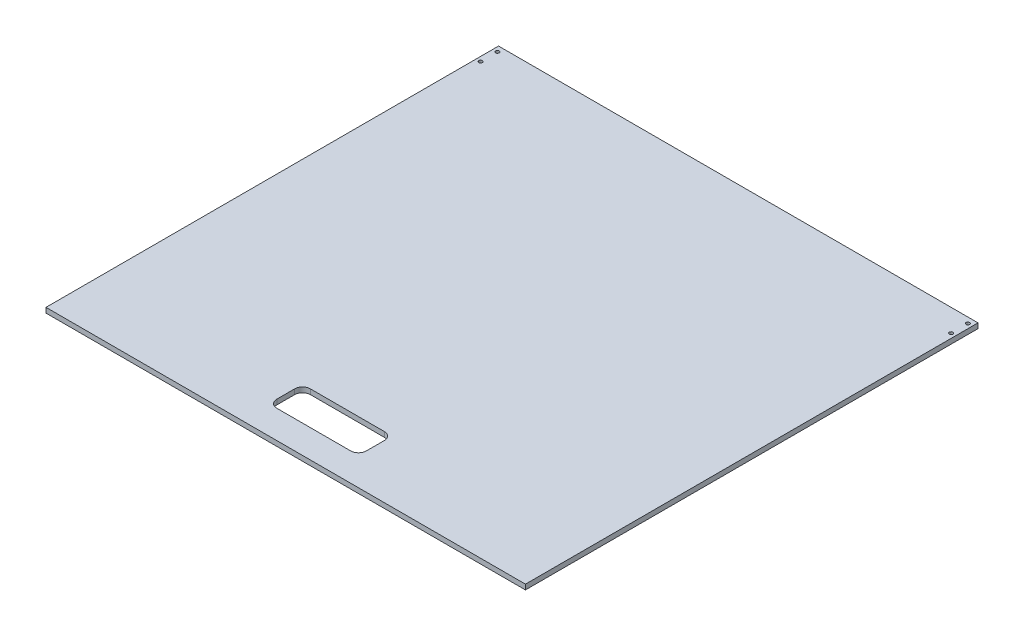
ISO-10303-21;
HEADER;
FILE_DESCRIPTION(('STEP AP214'),'2;1');
FILE_NAME('part.step','',(''),(''),'','','');
FILE_SCHEMA(('AUTOMOTIVE_DESIGN { 1 0 10303 214 1 1 1 1 }'));
ENDSEC;
DATA;
#1=APPLICATION_CONTEXT('core data for automotive mechanical design processes');
#2=APPLICATION_PROTOCOL_DEFINITION('international standard','automotive_design',2000,#1);
#3=PRODUCT_CONTEXT('',#1,'mechanical');
#4=PRODUCT('Part','Part','',(#3));
#5=PRODUCT_RELATED_PRODUCT_CATEGORY('part','',(#4));
#6=PRODUCT_DEFINITION_FORMATION('','',#4);
#7=PRODUCT_DEFINITION_CONTEXT('part definition',#1,'design');
#8=PRODUCT_DEFINITION('design','',#6,#7);
#9=PRODUCT_DEFINITION_SHAPE('','',#8);
#10=(LENGTH_UNIT() NAMED_UNIT(*) SI_UNIT(.MILLI.,.METRE.));
#11=(NAMED_UNIT(*) PLANE_ANGLE_UNIT() SI_UNIT($,.RADIAN.));
#12=(NAMED_UNIT(*) SI_UNIT($,.STERADIAN.) SOLID_ANGLE_UNIT());
#13=UNCERTAINTY_MEASURE_WITH_UNIT(LENGTH_MEASURE(1.E-05),#10,'distance_accuracy_value','');
#14=(GEOMETRIC_REPRESENTATION_CONTEXT(3) GLOBAL_UNCERTAINTY_ASSIGNED_CONTEXT((#13)) GLOBAL_UNIT_ASSIGNED_CONTEXT((#10,
#11,#12)) REPRESENTATION_CONTEXT('',''));
#15=CARTESIAN_POINT('',(0.,0.,0.));
#16=DIRECTION('',(0.,0.,1.));
#17=DIRECTION('',(1.,0.,0.));
#18=AXIS2_PLACEMENT_3D('',#15,#16,#17);
#19=CARTESIAN_POINT('',(214.,4.5,202.));
#20=DIRECTION('',(-1.,0.,0.));
#21=DIRECTION('',(0.,0.,1.));
#22=AXIS2_PLACEMENT_3D('',#19,#20,#21);
#23=PLANE('',#22);
#24=DIRECTION('',(0.,0.,-1.));
#25=VECTOR('',#24,1.);
#26=CARTESIAN_POINT('',(214.,0.,202.));
#27=LINE('',#26,#25);
#28=CARTESIAN_POINT('',(214.,0.,202.));
#29=VERTEX_POINT('',#28);
#30=CARTESIAN_POINT('',(214.,0.,-202.));
#31=VERTEX_POINT('',#30);
#32=EDGE_CURVE('E205',#29,#31,#27,.T.);
#33=ORIENTED_EDGE('',*,*,#32,.T.);
#34=DIRECTION('',(0.,-1.,0.));
#35=VECTOR('',#34,1.);
#36=CARTESIAN_POINT('',(214.,4.5,-202.));
#37=LINE('',#36,#35);
#38=CARTESIAN_POINT('',(214.,4.5,-202.));
#39=VERTEX_POINT('',#38);
#40=EDGE_CURVE('E11',#39,#31,#37,.T.);
#41=ORIENTED_EDGE('',*,*,#40,.F.);
#42=DIRECTION('',(0.,0.,-1.));
#43=VECTOR('',#42,1.);
#44=CARTESIAN_POINT('',(214.,4.5,202.));
#45=LINE('',#44,#43);
#46=CARTESIAN_POINT('',(214.,4.5,202.));
#47=VERTEX_POINT('',#46);
#48=EDGE_CURVE('E214',#47,#39,#45,.T.);
#49=ORIENTED_EDGE('',*,*,#48,.F.);
#50=DIRECTION('',(0.,-1.,0.));
#51=VECTOR('',#50,1.);
#52=CARTESIAN_POINT('',(214.,4.5,202.));
#53=LINE('',#52,#51);
#54=EDGE_CURVE('E224',#47,#29,#53,.T.);
#55=ORIENTED_EDGE('',*,*,#54,.T.);
#56=EDGE_LOOP('',(#33,#41,#49,#55));
#57=FACE_BOUND('',#56,.T.);
#58=ADVANCED_FACE('F33',(#57),#23,.F.);
#59=CARTESIAN_POINT('',(-214.,4.5,-202.));
#60=DIRECTION('',(0.,0.,1.));
#61=DIRECTION('',(1.,0.,0.));
#62=AXIS2_PLACEMENT_3D('',#59,#60,#61);
#63=PLANE('',#62);
#64=DIRECTION('',(-1.,0.,0.));
#65=VECTOR('',#64,1.);
#66=CARTESIAN_POINT('',(-214.,0.,-202.));
#67=LINE('',#66,#65);
#68=CARTESIAN_POINT('',(-214.,0.,-202.));
#69=VERTEX_POINT('',#68);
#70=EDGE_CURVE('E227',#31,#69,#67,.T.);
#71=ORIENTED_EDGE('',*,*,#70,.T.);
#72=DIRECTION('',(0.,-1.,0.));
#73=VECTOR('',#72,1.);
#74=CARTESIAN_POINT('',(-214.,4.5,-202.));
#75=LINE('',#74,#73);
#76=CARTESIAN_POINT('',(-214.,4.5,-202.));
#77=VERTEX_POINT('',#76);
#78=EDGE_CURVE('E40',#77,#69,#75,.T.);
#79=ORIENTED_EDGE('',*,*,#78,.F.);
#80=DIRECTION('',(-1.,0.,0.));
#81=VECTOR('',#80,1.);
#82=CARTESIAN_POINT('',(-214.,4.5,-202.));
#83=LINE('',#82,#81);
#84=EDGE_CURVE('E217',#39,#77,#83,.T.);
#85=ORIENTED_EDGE('',*,*,#84,.F.);
#86=ORIENTED_EDGE('',*,*,#40,.T.);
#87=EDGE_LOOP('',(#71,#79,#85,#86));
#88=FACE_BOUND('',#87,.T.);
#89=ADVANCED_FACE('F256',(#88),#63,.F.);
#90=CARTESIAN_POINT('',(-214.,4.5,202.));
#91=DIRECTION('',(1.,0.,0.));
#92=DIRECTION('',(0.,0.,-1.));
#93=AXIS2_PLACEMENT_3D('',#90,#91,#92);
#94=PLANE('',#93);
#95=DIRECTION('',(0.,0.,1.));
#96=VECTOR('',#95,1.);
#97=CARTESIAN_POINT('',(-214.,0.,202.));
#98=LINE('',#97,#96);
#99=CARTESIAN_POINT('',(-214.,0.,202.));
#100=VERTEX_POINT('',#99);
#101=EDGE_CURVE('E229',#69,#100,#98,.T.);
#102=ORIENTED_EDGE('',*,*,#101,.T.);
#103=DIRECTION('',(0.,-1.,0.));
#104=VECTOR('',#103,1.);
#105=CARTESIAN_POINT('',(-214.,4.5,202.));
#106=LINE('',#105,#104);
#107=CARTESIAN_POINT('',(-214.,4.5,202.));
#108=VERTEX_POINT('',#107);
#109=EDGE_CURVE('E234',#108,#100,#106,.T.);
#110=ORIENTED_EDGE('',*,*,#109,.F.);
#111=DIRECTION('',(0.,0.,1.));
#112=VECTOR('',#111,1.);
#113=CARTESIAN_POINT('',(-214.,4.5,202.));
#114=LINE('',#113,#112);
#115=EDGE_CURVE('E220',#77,#108,#114,.T.);
#116=ORIENTED_EDGE('',*,*,#115,.F.);
#117=ORIENTED_EDGE('',*,*,#78,.T.);
#118=EDGE_LOOP('',(#102,#110,#116,#117));
#119=FACE_BOUND('',#118,.T.);
#120=ADVANCED_FACE('F241',(#119),#94,.F.);
#121=CARTESIAN_POINT('',(-214.,4.5,202.));
#122=DIRECTION('',(0.,0.,-1.));
#123=DIRECTION('',(-1.,0.,0.));
#124=AXIS2_PLACEMENT_3D('',#121,#122,#123);
#125=PLANE('',#124);
#126=DIRECTION('',(1.,0.,0.));
#127=VECTOR('',#126,1.);
#128=CARTESIAN_POINT('',(-214.,0.,202.));
#129=LINE('',#128,#127);
#130=EDGE_CURVE('E218',#100,#29,#129,.T.);
#131=ORIENTED_EDGE('',*,*,#130,.T.);
#132=ORIENTED_EDGE('',*,*,#54,.F.);
#133=DIRECTION('',(1.,0.,0.));
#134=VECTOR('',#133,1.);
#135=CARTESIAN_POINT('',(-214.,4.5,202.));
#136=LINE('',#135,#134);
#137=EDGE_CURVE('E222',#108,#47,#136,.T.);
#138=ORIENTED_EDGE('',*,*,#137,.F.);
#139=ORIENTED_EDGE('',*,*,#109,.T.);
#140=EDGE_LOOP('',(#131,#132,#138,#139));
#141=FACE_BOUND('',#140,.T.);
#142=ADVANCED_FACE('F249',(#141),#125,.F.);
#143=CARTESIAN_POINT('',(0.,4.5,0.));
#144=DIRECTION('',(0.,-1.,0.));
#145=DIRECTION('',(0.,0.,-1.));
#146=AXIS2_PLACEMENT_3D('',#143,#144,#145);
#147=PLANE('',#146);
#148=DIRECTION('',(0.,0.,1.));
#149=VECTOR('',#148,1.);
#150=CARTESIAN_POINT('',(-40.0000000000001,4.5,170.));
#151=LINE('',#150,#149);
#152=CARTESIAN_POINT('',(-40.0000000000001,4.5,154.));
#153=VERTEX_POINT('',#152);
#154=CARTESIAN_POINT('',(-40.0000000000001,4.5,170.));
#155=VERTEX_POINT('',#154);
#156=EDGE_CURVE('E160',#153,#155,#151,.T.);
#157=ORIENTED_EDGE('',*,*,#156,.F.);
#158=CARTESIAN_POINT('',(-33.0000000000002,4.5,154.));
#159=DIRECTION('',(0.,1.,0.));
#160=DIRECTION('',(0.,0.,-1.));
#161=AXIS2_PLACEMENT_3D('',#158,#159,#160);
#162=CIRCLE('',#161,7.);
#163=CARTESIAN_POINT('',(-33.0000000000002,4.5,147.));
#164=VERTEX_POINT('',#163);
#165=EDGE_CURVE('E47',#164,#153,#162,.T.);
#166=ORIENTED_EDGE('',*,*,#165,.F.);
#167=DIRECTION('',(-1.,0.,0.));
#168=VECTOR('',#167,1.);
#169=CARTESIAN_POINT('',(-33.0000000000002,4.5,147.));
#170=LINE('',#169,#168);
#171=CARTESIAN_POINT('',(32.9999999999999,4.5,147.));
#172=VERTEX_POINT('',#171);
#173=EDGE_CURVE('E140',#172,#164,#170,.T.);
#174=ORIENTED_EDGE('',*,*,#173,.F.);
#175=CARTESIAN_POINT('',(32.9999999999999,4.5,154.));
#176=DIRECTION('',(0.,1.,0.));
#177=DIRECTION('',(0.,0.,-1.));
#178=AXIS2_PLACEMENT_3D('',#175,#176,#177);
#179=CIRCLE('',#178,7.00000000000001);
#180=CARTESIAN_POINT('',(39.9999999999999,4.5,154.));
#181=VERTEX_POINT('',#180);
#182=EDGE_CURVE('E143',#181,#172,#179,.T.);
#183=ORIENTED_EDGE('',*,*,#182,.F.);
#184=DIRECTION('',(0.,0.,-1.));
#185=VECTOR('',#184,1.);
#186=CARTESIAN_POINT('',(39.9999999999999,4.5,170.));
#187=LINE('',#186,#185);
#188=CARTESIAN_POINT('',(39.9999999999999,4.5,170.));
#189=VERTEX_POINT('',#188);
#190=EDGE_CURVE('E171',#189,#181,#187,.T.);
#191=ORIENTED_EDGE('',*,*,#190,.F.);
#192=CARTESIAN_POINT('',(32.9999999999999,4.5,170.));
#193=DIRECTION('',(0.,1.,0.));
#194=DIRECTION('',(0.,0.,1.));
#195=AXIS2_PLACEMENT_3D('',#192,#193,#194);
#196=CIRCLE('',#195,7.00000000000001);
#197=CARTESIAN_POINT('',(32.9999999999999,4.5,177.));
#198=VERTEX_POINT('',#197);
#199=EDGE_CURVE('E168',#198,#189,#196,.T.);
#200=ORIENTED_EDGE('',*,*,#199,.F.);
#201=DIRECTION('',(1.,0.,0.));
#202=VECTOR('',#201,1.);
#203=CARTESIAN_POINT('',(-33.0000000000002,4.5,177.));
#204=LINE('',#203,#202);
#205=CARTESIAN_POINT('',(-33.0000000000002,4.5,177.));
#206=VERTEX_POINT('',#205);
#207=EDGE_CURVE('E165',#206,#198,#204,.T.);
#208=ORIENTED_EDGE('',*,*,#207,.F.);
#209=CARTESIAN_POINT('',(-33.0000000000002,4.5,170.));
#210=DIRECTION('',(0.,1.,0.));
#211=DIRECTION('',(0.,0.,-1.));
#212=AXIS2_PLACEMENT_3D('',#209,#210,#211);
#213=CIRCLE('',#212,7.);
#214=EDGE_CURVE('E162',#155,#206,#213,.T.);
#215=ORIENTED_EDGE('',*,*,#214,.F.);
#216=EDGE_LOOP('',(#157,#166,#174,#183,#191,#200,#208,#215));
#217=FACE_BOUND('',#216,.T.);
#218=CARTESIAN_POINT('',(-210.,4.5,-182.));
#219=DIRECTION('',(0.,1.,0.));
#220=DIRECTION('',(0.,0.,-1.));
#221=AXIS2_PLACEMENT_3D('',#218,#219,#220);
#222=CIRCLE('',#221,1.59999999999999);
#223=CARTESIAN_POINT('',(-210.,4.5,-183.6));
#224=VERTEX_POINT('',#223);
#225=EDGE_CURVE('E190',#224,#224,#222,.T.);
#226=ORIENTED_EDGE('',*,*,#225,.F.);
#227=EDGE_LOOP('',(#226));
#228=FACE_BOUND('',#227,.T.);
#229=CARTESIAN_POINT('',(-210.,4.5,-197.));
#230=DIRECTION('',(0.,1.,0.));
#231=DIRECTION('',(0.,0.,-1.));
#232=AXIS2_PLACEMENT_3D('',#229,#230,#231);
#233=CIRCLE('',#232,1.59999999999999);
#234=CARTESIAN_POINT('',(-210.,4.5,-198.6));
#235=VERTEX_POINT('',#234);
#236=EDGE_CURVE('E197',#235,#235,#233,.T.);
#237=ORIENTED_EDGE('',*,*,#236,.F.);
#238=EDGE_LOOP('',(#237));
#239=FACE_BOUND('',#238,.T.);
#240=CARTESIAN_POINT('',(210.,4.5,-182.));
#241=DIRECTION('',(0.,-1.,0.));
#242=DIRECTION('',(0.,0.,-1.));
#243=AXIS2_PLACEMENT_3D('',#240,#241,#242);
#244=CIRCLE('',#243,1.59999999999999);
#245=CARTESIAN_POINT('',(210.,4.5,-183.6));
#246=VERTEX_POINT('',#245);
#247=EDGE_CURVE('E202',#246,#246,#244,.T.);
#248=ORIENTED_EDGE('',*,*,#247,.T.);
#249=EDGE_LOOP('',(#248));
#250=FACE_BOUND('',#249,.T.);
#251=CARTESIAN_POINT('',(210.,4.5,-197.));
#252=DIRECTION('',(0.,-1.,0.));
#253=DIRECTION('',(0.,0.,-1.));
#254=AXIS2_PLACEMENT_3D('',#251,#252,#253);
#255=CIRCLE('',#254,1.59999999999999);
#256=CARTESIAN_POINT('',(210.,4.5,-198.6));
#257=VERTEX_POINT('',#256);
#258=EDGE_CURVE('E209',#257,#257,#255,.T.);
#259=ORIENTED_EDGE('',*,*,#258,.T.);
#260=EDGE_LOOP('',(#259));
#261=FACE_BOUND('',#260,.T.);
#262=ORIENTED_EDGE('',*,*,#48,.T.);
#263=ORIENTED_EDGE('',*,*,#84,.T.);
#264=ORIENTED_EDGE('',*,*,#115,.T.);
#265=ORIENTED_EDGE('',*,*,#137,.T.);
#266=EDGE_LOOP('',(#262,#263,#264,#265));
#267=FACE_BOUND('',#266,.T.);
#268=ADVANCED_FACE('F255',(#217,#228,#239,#250,#261,#267),#147,.F.);
#269=CARTESIAN_POINT('',(0.,0.,0.));
#270=DIRECTION('',(0.,-1.,0.));
#271=DIRECTION('',(0.,0.,-1.));
#272=AXIS2_PLACEMENT_3D('',#269,#270,#271);
#273=PLANE('',#272);
#274=CARTESIAN_POINT('',(-33.0000000000002,0.,154.));
#275=DIRECTION('',(0.,1.,0.));
#276=DIRECTION('',(0.,0.,-1.));
#277=AXIS2_PLACEMENT_3D('',#274,#275,#276);
#278=CIRCLE('',#277,7.);
#279=CARTESIAN_POINT('',(-33.0000000000002,0.,147.));
#280=VERTEX_POINT('',#279);
#281=CARTESIAN_POINT('',(-40.0000000000001,0.,154.));
#282=VERTEX_POINT('',#281);
#283=EDGE_CURVE('E123',#280,#282,#278,.T.);
#284=ORIENTED_EDGE('',*,*,#283,.T.);
#285=DIRECTION('',(0.,0.,1.));
#286=VECTOR('',#285,1.);
#287=CARTESIAN_POINT('',(-40.0000000000001,0.,170.));
#288=LINE('',#287,#286);
#289=CARTESIAN_POINT('',(-40.0000000000001,0.,170.));
#290=VERTEX_POINT('',#289);
#291=EDGE_CURVE('E132',#282,#290,#288,.T.);
#292=ORIENTED_EDGE('',*,*,#291,.T.);
#293=CARTESIAN_POINT('',(-33.0000000000002,0.,170.));
#294=DIRECTION('',(0.,1.,0.));
#295=DIRECTION('',(0.,0.,-1.));
#296=AXIS2_PLACEMENT_3D('',#293,#294,#295);
#297=CIRCLE('',#296,7.);
#298=CARTESIAN_POINT('',(-33.0000000000002,0.,177.));
#299=VERTEX_POINT('',#298);
#300=EDGE_CURVE('E55',#290,#299,#297,.T.);
#301=ORIENTED_EDGE('',*,*,#300,.T.);
#302=DIRECTION('',(1.,0.,0.));
#303=VECTOR('',#302,1.);
#304=CARTESIAN_POINT('',(-33.0000000000002,0.,177.));
#305=LINE('',#304,#303);
#306=CARTESIAN_POINT('',(32.9999999999999,0.,177.));
#307=VERTEX_POINT('',#306);
#308=EDGE_CURVE('E147',#299,#307,#305,.T.);
#309=ORIENTED_EDGE('',*,*,#308,.T.);
#310=CARTESIAN_POINT('',(32.9999999999999,0.,170.));
#311=DIRECTION('',(0.,1.,0.));
#312=DIRECTION('',(0.,0.,1.));
#313=AXIS2_PLACEMENT_3D('',#310,#311,#312);
#314=CIRCLE('',#313,7.00000000000001);
#315=CARTESIAN_POINT('',(39.9999999999999,0.,170.));
#316=VERTEX_POINT('',#315);
#317=EDGE_CURVE('E150',#307,#316,#314,.T.);
#318=ORIENTED_EDGE('',*,*,#317,.T.);
#319=DIRECTION('',(0.,0.,-1.));
#320=VECTOR('',#319,1.);
#321=CARTESIAN_POINT('',(39.9999999999999,0.,170.));
#322=LINE('',#321,#320);
#323=CARTESIAN_POINT('',(39.9999999999999,0.,154.));
#324=VERTEX_POINT('',#323);
#325=EDGE_CURVE('E153',#316,#324,#322,.T.);
#326=ORIENTED_EDGE('',*,*,#325,.T.);
#327=CARTESIAN_POINT('',(32.9999999999999,0.,154.));
#328=DIRECTION('',(0.,1.,0.));
#329=DIRECTION('',(0.,0.,-1.));
#330=AXIS2_PLACEMENT_3D('',#327,#328,#329);
#331=CIRCLE('',#330,7.00000000000001);
#332=CARTESIAN_POINT('',(32.9999999999999,0.,147.));
#333=VERTEX_POINT('',#332);
#334=EDGE_CURVE('E156',#324,#333,#331,.T.);
#335=ORIENTED_EDGE('',*,*,#334,.T.);
#336=DIRECTION('',(-1.,0.,0.));
#337=VECTOR('',#336,1.);
#338=CARTESIAN_POINT('',(-33.0000000000002,0.,147.));
#339=LINE('',#338,#337);
#340=EDGE_CURVE('E129',#333,#280,#339,.T.);
#341=ORIENTED_EDGE('',*,*,#340,.T.);
#342=EDGE_LOOP('',(#284,#292,#301,#309,#318,#326,#335,#341));
#343=FACE_BOUND('',#342,.T.);
#344=CARTESIAN_POINT('',(-210.,0.,-182.));
#345=DIRECTION('',(0.,1.,0.));
#346=DIRECTION('',(0.,0.,-1.));
#347=AXIS2_PLACEMENT_3D('',#344,#345,#346);
#348=CIRCLE('',#347,1.59999999999999);
#349=CARTESIAN_POINT('',(-210.,0.,-183.6));
#350=VERTEX_POINT('',#349);
#351=EDGE_CURVE('E194',#350,#350,#348,.T.);
#352=ORIENTED_EDGE('',*,*,#351,.T.);
#353=EDGE_LOOP('',(#352));
#354=FACE_BOUND('',#353,.T.);
#355=CARTESIAN_POINT('',(-210.,0.,-197.));
#356=DIRECTION('',(0.,1.,0.));
#357=DIRECTION('',(0.,0.,-1.));
#358=AXIS2_PLACEMENT_3D('',#355,#356,#357);
#359=CIRCLE('',#358,1.59999999999999);
#360=CARTESIAN_POINT('',(-210.,0.,-198.6));
#361=VERTEX_POINT('',#360);
#362=EDGE_CURVE('E178',#361,#361,#359,.T.);
#363=ORIENTED_EDGE('',*,*,#362,.T.);
#364=EDGE_LOOP('',(#363));
#365=FACE_BOUND('',#364,.T.);
#366=CARTESIAN_POINT('',(210.,0.,-182.));
#367=DIRECTION('',(0.,-1.,0.));
#368=DIRECTION('',(0.,0.,-1.));
#369=AXIS2_PLACEMENT_3D('',#366,#367,#368);
#370=CIRCLE('',#369,1.59999999999999);
#371=CARTESIAN_POINT('',(210.,0.,-183.6));
#372=VERTEX_POINT('',#371);
#373=EDGE_CURVE('E206',#372,#372,#370,.T.);
#374=ORIENTED_EDGE('',*,*,#373,.F.);
#375=EDGE_LOOP('',(#374));
#376=FACE_BOUND('',#375,.T.);
#377=CARTESIAN_POINT('',(210.,0.,-197.));
#378=DIRECTION('',(0.,-1.,0.));
#379=DIRECTION('',(0.,0.,-1.));
#380=AXIS2_PLACEMENT_3D('',#377,#378,#379);
#381=CIRCLE('',#380,1.59999999999999);
#382=CARTESIAN_POINT('',(210.,0.,-198.6));
#383=VERTEX_POINT('',#382);
#384=EDGE_CURVE('E193',#383,#383,#381,.T.);
#385=ORIENTED_EDGE('',*,*,#384,.F.);
#386=EDGE_LOOP('',(#385));
#387=FACE_BOUND('',#386,.T.);
#388=ORIENTED_EDGE('',*,*,#32,.F.);
#389=ORIENTED_EDGE('',*,*,#130,.F.);
#390=ORIENTED_EDGE('',*,*,#101,.F.);
#391=ORIENTED_EDGE('',*,*,#70,.F.);
#392=EDGE_LOOP('',(#388,#389,#390,#391));
#393=FACE_BOUND('',#392,.T.);
#394=ADVANCED_FACE('F136',(#343,#354,#365,#376,#387,#393),#273,.T.);
#395=CARTESIAN_POINT('',(210.,4.5,-197.));
#396=DIRECTION('',(0.,-1.,0.));
#397=DIRECTION('',(0.,0.,-1.));
#398=AXIS2_PLACEMENT_3D('',#395,#396,#397);
#399=CYLINDRICAL_SURFACE('',#398,1.59999999999999);
#400=ORIENTED_EDGE('',*,*,#258,.F.);
#401=EDGE_LOOP('',(#400));
#402=FACE_BOUND('',#401,.T.);
#403=ORIENTED_EDGE('',*,*,#384,.T.);
#404=EDGE_LOOP('',(#403));
#405=FACE_BOUND('',#404,.T.);
#406=ADVANCED_FACE('F268',(#402,#405),#399,.F.);
#407=CARTESIAN_POINT('',(210.,4.5,-182.));
#408=DIRECTION('',(0.,-1.,0.));
#409=DIRECTION('',(0.,0.,-1.));
#410=AXIS2_PLACEMENT_3D('',#407,#408,#409);
#411=CYLINDRICAL_SURFACE('',#410,1.59999999999999);
#412=ORIENTED_EDGE('',*,*,#247,.F.);
#413=EDGE_LOOP('',(#412));
#414=FACE_BOUND('',#413,.T.);
#415=ORIENTED_EDGE('',*,*,#373,.T.);
#416=EDGE_LOOP('',(#415));
#417=FACE_BOUND('',#416,.T.);
#418=ADVANCED_FACE('F274',(#414,#417),#411,.F.);
#419=CARTESIAN_POINT('',(-210.,4.5,-197.));
#420=DIRECTION('',(0.,-1.,0.));
#421=DIRECTION('',(0.,0.,-1.));
#422=AXIS2_PLACEMENT_3D('',#419,#420,#421);
#423=CYLINDRICAL_SURFACE('',#422,1.59999999999999);
#424=ORIENTED_EDGE('',*,*,#236,.T.);
#425=EDGE_LOOP('',(#424));
#426=FACE_BOUND('',#425,.T.);
#427=ORIENTED_EDGE('',*,*,#362,.F.);
#428=EDGE_LOOP('',(#427));
#429=FACE_BOUND('',#428,.T.);
#430=ADVANCED_FACE('F278',(#426,#429),#423,.F.);
#431=CARTESIAN_POINT('',(-210.,4.5,-182.));
#432=DIRECTION('',(0.,-1.,0.));
#433=DIRECTION('',(0.,0.,-1.));
#434=AXIS2_PLACEMENT_3D('',#431,#432,#433);
#435=CYLINDRICAL_SURFACE('',#434,1.59999999999999);
#436=ORIENTED_EDGE('',*,*,#225,.T.);
#437=EDGE_LOOP('',(#436));
#438=FACE_BOUND('',#437,.T.);
#439=ORIENTED_EDGE('',*,*,#351,.F.);
#440=EDGE_LOOP('',(#439));
#441=FACE_BOUND('',#440,.T.);
#442=ADVANCED_FACE('F282',(#438,#441),#435,.F.);
#443=CARTESIAN_POINT('',(-33.0000000000002,0.,154.));
#444=DIRECTION('',(0.,1.,0.));
#445=DIRECTION('',(0.,0.,1.));
#446=AXIS2_PLACEMENT_3D('',#443,#444,#445);
#447=CYLINDRICAL_SURFACE('',#446,7.);
#448=ORIENTED_EDGE('',*,*,#165,.T.);
#449=DIRECTION('',(0.,1.,0.));
#450=VECTOR('',#449,1.);
#451=CARTESIAN_POINT('',(-40.0000000000001,0.,154.));
#452=LINE('',#451,#450);
#453=EDGE_CURVE('E119',#282,#153,#452,.T.);
#454=ORIENTED_EDGE('',*,*,#453,.F.);
#455=ORIENTED_EDGE('',*,*,#283,.F.);
#456=DIRECTION('',(0.,1.,0.));
#457=VECTOR('',#456,1.);
#458=CARTESIAN_POINT('',(-33.0000000000002,0.,147.));
#459=LINE('',#458,#457);
#460=EDGE_CURVE('E176',#280,#164,#459,.T.);
#461=ORIENTED_EDGE('',*,*,#460,.T.);
#462=EDGE_LOOP('',(#448,#454,#455,#461));
#463=FACE_BOUND('',#462,.T.);
#464=ADVANCED_FACE('F121',(#463),#447,.F.);
#465=CARTESIAN_POINT('',(-33.0000000000002,0.,147.));
#466=DIRECTION('',(0.,0.,-1.));
#467=DIRECTION('',(-1.,0.,0.));
#468=AXIS2_PLACEMENT_3D('',#465,#466,#467);
#469=PLANE('',#468);
#470=ORIENTED_EDGE('',*,*,#173,.T.);
#471=ORIENTED_EDGE('',*,*,#460,.F.);
#472=ORIENTED_EDGE('',*,*,#340,.F.);
#473=DIRECTION('',(0.,1.,0.));
#474=VECTOR('',#473,1.);
#475=CARTESIAN_POINT('',(32.9999999999999,0.,147.));
#476=LINE('',#475,#474);
#477=EDGE_CURVE('E179',#333,#172,#476,.T.);
#478=ORIENTED_EDGE('',*,*,#477,.T.);
#479=EDGE_LOOP('',(#470,#471,#472,#478));
#480=FACE_BOUND('',#479,.T.);
#481=ADVANCED_FACE('F289',(#480),#469,.F.);
#482=CARTESIAN_POINT('',(32.9999999999999,0.,154.));
#483=DIRECTION('',(0.,1.,0.));
#484=DIRECTION('',(0.,0.,1.));
#485=AXIS2_PLACEMENT_3D('',#482,#483,#484);
#486=CYLINDRICAL_SURFACE('',#485,7.00000000000001);
#487=ORIENTED_EDGE('',*,*,#182,.T.);
#488=ORIENTED_EDGE('',*,*,#477,.F.);
#489=ORIENTED_EDGE('',*,*,#334,.F.);
#490=DIRECTION('',(0.,1.,0.));
#491=VECTOR('',#490,1.);
#492=CARTESIAN_POINT('',(39.9999999999999,0.,154.));
#493=LINE('',#492,#491);
#494=EDGE_CURVE('E181',#324,#181,#493,.T.);
#495=ORIENTED_EDGE('',*,*,#494,.T.);
#496=EDGE_LOOP('',(#487,#488,#489,#495));
#497=FACE_BOUND('',#496,.T.);
#498=ADVANCED_FACE('F306',(#497),#486,.F.);
#499=CARTESIAN_POINT('',(39.9999999999999,0.,170.));
#500=DIRECTION('',(1.,0.,0.));
#501=DIRECTION('',(0.,0.,-1.));
#502=AXIS2_PLACEMENT_3D('',#499,#500,#501);
#503=PLANE('',#502);
#504=ORIENTED_EDGE('',*,*,#190,.T.);
#505=ORIENTED_EDGE('',*,*,#494,.F.);
#506=ORIENTED_EDGE('',*,*,#325,.F.);
#507=DIRECTION('',(0.,1.,0.));
#508=VECTOR('',#507,1.);
#509=CARTESIAN_POINT('',(39.9999999999999,0.,170.));
#510=LINE('',#509,#508);
#511=EDGE_CURVE('E183',#316,#189,#510,.T.);
#512=ORIENTED_EDGE('',*,*,#511,.T.);
#513=EDGE_LOOP('',(#504,#505,#506,#512));
#514=FACE_BOUND('',#513,.T.);
#515=ADVANCED_FACE('F302',(#514),#503,.F.);
#516=CARTESIAN_POINT('',(32.9999999999999,0.,170.));
#517=DIRECTION('',(0.,1.,0.));
#518=DIRECTION('',(0.,0.,1.));
#519=AXIS2_PLACEMENT_3D('',#516,#517,#518);
#520=CYLINDRICAL_SURFACE('',#519,7.00000000000001);
#521=ORIENTED_EDGE('',*,*,#199,.T.);
#522=ORIENTED_EDGE('',*,*,#511,.F.);
#523=ORIENTED_EDGE('',*,*,#317,.F.);
#524=DIRECTION('',(0.,1.,0.));
#525=VECTOR('',#524,1.);
#526=CARTESIAN_POINT('',(32.9999999999999,0.,177.));
#527=LINE('',#526,#525);
#528=EDGE_CURVE('E185',#307,#198,#527,.T.);
#529=ORIENTED_EDGE('',*,*,#528,.T.);
#530=EDGE_LOOP('',(#521,#522,#523,#529));
#531=FACE_BOUND('',#530,.T.);
#532=ADVANCED_FACE('F298',(#531),#520,.F.);
#533=CARTESIAN_POINT('',(-33.0000000000002,0.,177.));
#534=DIRECTION('',(0.,0.,1.));
#535=DIRECTION('',(1.,0.,0.));
#536=AXIS2_PLACEMENT_3D('',#533,#534,#535);
#537=PLANE('',#536);
#538=ORIENTED_EDGE('',*,*,#207,.T.);
#539=ORIENTED_EDGE('',*,*,#528,.F.);
#540=ORIENTED_EDGE('',*,*,#308,.F.);
#541=DIRECTION('',(0.,1.,0.));
#542=VECTOR('',#541,1.);
#543=CARTESIAN_POINT('',(-33.0000000000002,0.,177.));
#544=LINE('',#543,#542);
#545=EDGE_CURVE('E187',#299,#206,#544,.T.);
#546=ORIENTED_EDGE('',*,*,#545,.T.);
#547=EDGE_LOOP('',(#538,#539,#540,#546));
#548=FACE_BOUND('',#547,.T.);
#549=ADVANCED_FACE('F295',(#548),#537,.F.);
#550=CARTESIAN_POINT('',(-33.0000000000002,0.,170.));
#551=DIRECTION('',(0.,1.,0.));
#552=DIRECTION('',(0.,0.,1.));
#553=AXIS2_PLACEMENT_3D('',#550,#551,#552);
#554=CYLINDRICAL_SURFACE('',#553,7.);
#555=ORIENTED_EDGE('',*,*,#214,.T.);
#556=ORIENTED_EDGE('',*,*,#545,.F.);
#557=ORIENTED_EDGE('',*,*,#300,.F.);
#558=DIRECTION('',(0.,1.,0.));
#559=VECTOR('',#558,1.);
#560=CARTESIAN_POINT('',(-40.0000000000001,0.,170.));
#561=LINE('',#560,#559);
#562=EDGE_CURVE('E128',#290,#155,#561,.T.);
#563=ORIENTED_EDGE('',*,*,#562,.T.);
#564=EDGE_LOOP('',(#555,#556,#557,#563));
#565=FACE_BOUND('',#564,.T.);
#566=ADVANCED_FACE('F292',(#565),#554,.F.);
#567=CARTESIAN_POINT('',(-40.0000000000001,0.,170.));
#568=DIRECTION('',(-1.,0.,0.));
#569=DIRECTION('',(0.,0.,1.));
#570=AXIS2_PLACEMENT_3D('',#567,#568,#569);
#571=PLANE('',#570);
#572=ORIENTED_EDGE('',*,*,#156,.T.);
#573=ORIENTED_EDGE('',*,*,#562,.F.);
#574=ORIENTED_EDGE('',*,*,#291,.F.);
#575=ORIENTED_EDGE('',*,*,#453,.T.);
#576=EDGE_LOOP('',(#572,#573,#574,#575));
#577=FACE_BOUND('',#576,.T.);
#578=ADVANCED_FACE('F133',(#577),#571,.F.);
#579=CLOSED_SHELL('',(#58,#89,#120,#142,#268,#394,#406,#418,#430,#442,#464,#481,#498,#515,#532,
#549,#566,#578));
#580=MANIFOLD_SOLID_BREP('B2',#579);
#581=ADVANCED_BREP_SHAPE_REPRESENTATION('',(#18,#580),#14);
#582=SHAPE_DEFINITION_REPRESENTATION(#9,#581);
ENDSEC;
END-ISO-10303-21;
